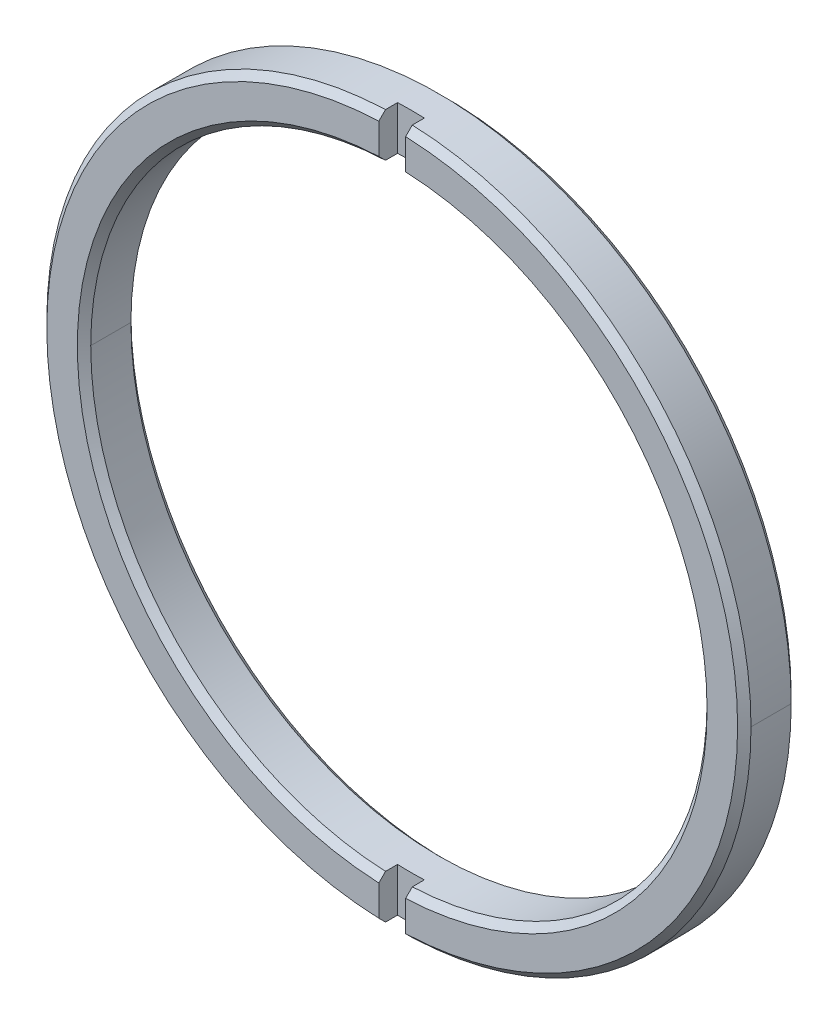
ISO-10303-21;
HEADER;
FILE_DESCRIPTION(('STEP AP214'),'2;1');
FILE_NAME('part.step','',(''),(''),'','','');
FILE_SCHEMA(('AUTOMOTIVE_DESIGN { 1 0 10303 214 1 1 1 1 }'));
ENDSEC;
DATA;
#1=APPLICATION_CONTEXT('core data for automotive mechanical design processes');
#2=APPLICATION_PROTOCOL_DEFINITION('international standard','automotive_design',2000,#1);
#3=PRODUCT_CONTEXT('',#1,'mechanical');
#4=PRODUCT('Part','Part','',(#3));
#5=PRODUCT_RELATED_PRODUCT_CATEGORY('part','',(#4));
#6=PRODUCT_DEFINITION_FORMATION('','',#4);
#7=PRODUCT_DEFINITION_CONTEXT('part definition',#1,'design');
#8=PRODUCT_DEFINITION('design','',#6,#7);
#9=PRODUCT_DEFINITION_SHAPE('','',#8);
#10=(LENGTH_UNIT() NAMED_UNIT(*) SI_UNIT(.MILLI.,.METRE.));
#11=(NAMED_UNIT(*) PLANE_ANGLE_UNIT() SI_UNIT($,.RADIAN.));
#12=(NAMED_UNIT(*) SI_UNIT($,.STERADIAN.) SOLID_ANGLE_UNIT());
#13=UNCERTAINTY_MEASURE_WITH_UNIT(LENGTH_MEASURE(1.E-05),#10,'distance_accuracy_value','');
#14=(GEOMETRIC_REPRESENTATION_CONTEXT(3) GLOBAL_UNCERTAINTY_ASSIGNED_CONTEXT((#13)) GLOBAL_UNIT_ASSIGNED_CONTEXT((#10,
#11,#12)) REPRESENTATION_CONTEXT('',''));
#15=CARTESIAN_POINT('',(0.,0.,0.));
#16=DIRECTION('',(0.,0.,1.));
#17=DIRECTION('',(1.,0.,0.));
#18=AXIS2_PLACEMENT_3D('',#15,#16,#17);
#19=CARTESIAN_POINT('',(-0.500000000000007,55.,1.3));
#20=DIRECTION('',(-1.,0.,0.));
#21=DIRECTION('',(0.,1.,0.));
#22=AXIS2_PLACEMENT_3D('',#19,#20,#21);
#23=PLANE('',#22);
#24=DIRECTION('',(0.,0.,-1.));
#25=VECTOR('',#24,1.);
#26=CARTESIAN_POINT('',(-0.5,11.4936295507555,2.));
#27=LINE('',#26,#25);
#28=CARTESIAN_POINT('',(-0.5,11.4936295507555,1.75));
#29=VERTEX_POINT('',#28);
#30=CARTESIAN_POINT('',(-0.5,11.4936295507555,1.3));
#31=VERTEX_POINT('',#30);
#32=EDGE_CURVE('E250',#29,#31,#27,.T.);
#33=ORIENTED_EDGE('',*,*,#32,.T.);
#34=DIRECTION('',(0.,-1.,0.));
#35=VECTOR('',#34,1.);
#36=CARTESIAN_POINT('',(-0.500000000000007,55.,1.3));
#37=LINE('',#36,#35);
#38=CARTESIAN_POINT('',(-0.5,13.1349868766588,1.3));
#39=VERTEX_POINT('',#38);
#40=EDGE_CURVE('E25',#39,#31,#37,.T.);
#41=ORIENTED_EDGE('',*,*,#40,.F.);
#42=DIRECTION('',(0.,0.,-1.));
#43=VECTOR('',#42,1.);
#44=CARTESIAN_POINT('',(-0.5,13.1349868766588,2.));
#45=LINE('',#44,#43);
#46=CARTESIAN_POINT('',(-0.5,13.1349868766588,1.75));
#47=VERTEX_POINT('',#46);
#48=EDGE_CURVE('E204',#47,#39,#45,.T.);
#49=ORIENTED_EDGE('',*,*,#48,.F.);
#50=CARTESIAN_POINT('',(-0.5,13.1349868766588,1.75));
#51=CARTESIAN_POINT('',(-0.5,13.0515926022637,1.83333391911205));
#52=CARTESIAN_POINT('',(-0.5,12.9681977539559,1.91666726381099));
#53=CARTESIAN_POINT('',(-0.5,12.8848022976684,2.));
#54=(BOUNDED_CURVE() B_SPLINE_CURVE(3,(#50,#51,#52,#53),.UNSPECIFIED.,.F.,
.F.) B_SPLINE_CURVE_WITH_KNOTS((4,4),(0.0223119172941757,0.0226656012251179),
.UNSPECIFIED.) CURVE() GEOMETRIC_REPRESENTATION_ITEM() RATIONAL_B_SPLINE_CURVE((1.,1.,1.,1.)) REPRESENTATION_ITEM(''));
#55=CARTESIAN_POINT('',(-0.5,12.8848022976684,2.));
#56=VERTEX_POINT('',#55);
#57=EDGE_CURVE('E216',#47,#56,#54,.T.);
#58=ORIENTED_EDGE('',*,*,#57,.T.);
#59=DIRECTION('',(0.,-1.,0.));
#60=VECTOR('',#59,1.);
#61=CARTESIAN_POINT('',(-0.500000000000007,55.,2.));
#62=LINE('',#61,#60);
#63=CARTESIAN_POINT('',(-0.5,11.7438609600931,2.));
#64=VERTEX_POINT('',#63);
#65=EDGE_CURVE('E315',#56,#64,#62,.T.);
#66=ORIENTED_EDGE('',*,*,#65,.T.);
#67=CARTESIAN_POINT('',(-0.5,11.7438609600931,2.));
#68=CARTESIAN_POINT('',(-0.5,11.6604513109038,1.91666584518184));
#69=CARTESIAN_POINT('',(-0.5,11.5770408589732,1.83333249398042));
#70=CARTESIAN_POINT('',(-0.5,11.4936295507555,1.75));
#71=(BOUNDED_CURVE() B_SPLINE_CURVE(3,(#67,#68,#69,#70),.UNSPECIFIED.,.F.,
.F.) B_SPLINE_CURVE_WITH_KNOTS((4,4),(0.0199535627771863,0.0203072798355382),
.UNSPECIFIED.) CURVE() GEOMETRIC_REPRESENTATION_ITEM() RATIONAL_B_SPLINE_CURVE((1.,1.,1.,1.)) REPRESENTATION_ITEM(''));
#72=EDGE_CURVE('E40',#64,#29,#71,.T.);
#73=ORIENTED_EDGE('',*,*,#72,.T.);
#74=EDGE_LOOP('',(#33,#41,#49,#58,#66,#73));
#75=FACE_BOUND('',#74,.T.);
#76=ADVANCED_FACE('F14',(#75),#23,.F.);
#77=CARTESIAN_POINT('',(0.499999999999993,55.,1.3));
#78=DIRECTION('',(1.,0.,0.));
#79=DIRECTION('',(0.,1.,0.));
#80=AXIS2_PLACEMENT_3D('',#77,#78,#79);
#81=PLANE('',#80);
#82=DIRECTION('',(0.,0.,1.));
#83=VECTOR('',#82,1.);
#84=CARTESIAN_POINT('',(0.5,11.4936295507555,2.));
#85=LINE('',#84,#83);
#86=CARTESIAN_POINT('',(0.5,11.4936295507555,1.3));
#87=VERTEX_POINT('',#86);
#88=CARTESIAN_POINT('',(0.5,11.4936295507555,1.75));
#89=VERTEX_POINT('',#88);
#90=EDGE_CURVE('E281',#87,#89,#85,.T.);
#91=ORIENTED_EDGE('',*,*,#90,.T.);
#92=CARTESIAN_POINT('',(0.5,11.4936295507555,1.75));
#93=CARTESIAN_POINT('',(0.5,11.5770408591299,1.83333249413706));
#94=CARTESIAN_POINT('',(0.5,11.6604513110572,1.91666584533513));
#95=CARTESIAN_POINT('',(0.5,11.7438609600931,2.));
#96=(BOUNDED_CURVE() B_SPLINE_CURVE(3,(#92,#93,#94,#95),.UNSPECIFIED.,.F.,
.F.) B_SPLINE_CURVE_WITH_KNOTS((4,4),(0.0523519426183359,0.0527083485669853),
.UNSPECIFIED.) CURVE() GEOMETRIC_REPRESENTATION_ITEM() RATIONAL_B_SPLINE_CURVE((1.,1.,1.,1.)) REPRESENTATION_ITEM(''));
#97=CARTESIAN_POINT('',(0.5,11.7438609600931,2.));
#98=VERTEX_POINT('',#97);
#99=EDGE_CURVE('E225',#89,#98,#96,.T.);
#100=ORIENTED_EDGE('',*,*,#99,.T.);
#101=DIRECTION('',(0.,1.,0.));
#102=VECTOR('',#101,1.);
#103=CARTESIAN_POINT('',(0.499999999999993,55.,2.));
#104=LINE('',#103,#102);
#105=CARTESIAN_POINT('',(0.5,12.8848022976684,2.));
#106=VERTEX_POINT('',#105);
#107=EDGE_CURVE('E328',#98,#106,#104,.T.);
#108=ORIENTED_EDGE('',*,*,#107,.T.);
#109=CARTESIAN_POINT('',(0.5,12.8848022976684,2.));
#110=CARTESIAN_POINT('',(0.5,12.9681977541026,1.91666726366442));
#111=CARTESIAN_POINT('',(0.5,13.0515926024076,1.83333391896827));
#112=CARTESIAN_POINT('',(0.5,13.1349868766588,1.75));
#113=(BOUNDED_CURVE() B_SPLINE_CURVE(3,(#109,#110,#111,#112),.UNSPECIFIED.,.F.,
.F.) B_SPLINE_CURVE_WITH_KNOTS((4,4),(0.0585562021967871,0.0589105675960562),
.UNSPECIFIED.) CURVE() GEOMETRIC_REPRESENTATION_ITEM() RATIONAL_B_SPLINE_CURVE((1.,1.,1.,1.)) REPRESENTATION_ITEM(''));
#114=CARTESIAN_POINT('',(0.5,13.1349868766588,1.75));
#115=VERTEX_POINT('',#114);
#116=EDGE_CURVE('E164',#106,#115,#113,.T.);
#117=ORIENTED_EDGE('',*,*,#116,.T.);
#118=DIRECTION('',(0.,0.,1.));
#119=VECTOR('',#118,1.);
#120=CARTESIAN_POINT('',(0.5,13.1349868766588,2.));
#121=LINE('',#120,#119);
#122=CARTESIAN_POINT('',(0.5,13.1349868766588,1.3));
#123=VERTEX_POINT('',#122);
#124=EDGE_CURVE('E194',#123,#115,#121,.T.);
#125=ORIENTED_EDGE('',*,*,#124,.F.);
#126=DIRECTION('',(0.,1.,0.));
#127=VECTOR('',#126,1.);
#128=CARTESIAN_POINT('',(0.499999999999993,55.,1.3));
#129=LINE('',#128,#127);
#130=EDGE_CURVE('E9',#87,#123,#129,.T.);
#131=ORIENTED_EDGE('',*,*,#130,.F.);
#132=EDGE_LOOP('',(#91,#100,#108,#117,#125,#131));
#133=FACE_BOUND('',#132,.T.);
#134=ADVANCED_FACE('F681',(#133),#81,.F.);
#135=CARTESIAN_POINT('',(0.,0.,1.3));
#136=DIRECTION('',(0.,0.,1.));
#137=DIRECTION('',(1.,0.,0.));
#138=AXIS2_PLACEMENT_3D('',#135,#136,#137);
#139=PLANE('',#138);
#140=CARTESIAN_POINT('',(0.,0.,1.3));
#141=DIRECTION('',(0.,0.,1.));
#142=DIRECTION('',(1.,0.,0.));
#143=AXIS2_PLACEMENT_3D('',#140,#141,#142);
#144=CIRCLE('',#143,13.1445);
#145=EDGE_CURVE('E208',#123,#39,#144,.T.);
#146=ORIENTED_EDGE('',*,*,#145,.T.);
#147=ORIENTED_EDGE('',*,*,#40,.T.);
#148=CARTESIAN_POINT('',(0.,0.,1.3));
#149=DIRECTION('',(0.,0.,1.));
#150=DIRECTION('',(1.,0.,0.));
#151=AXIS2_PLACEMENT_3D('',#148,#149,#150);
#152=CIRCLE('',#151,11.5045);
#153=EDGE_CURVE('E252',#87,#31,#152,.T.);
#154=ORIENTED_EDGE('',*,*,#153,.F.);
#155=ORIENTED_EDGE('',*,*,#130,.T.);
#156=EDGE_LOOP('',(#146,#147,#154,#155));
#157=FACE_BOUND('',#156,.T.);
#158=ADVANCED_FACE('F457',(#157),#139,.T.);
#159=CARTESIAN_POINT('',(0.,0.,1.3));
#160=DIRECTION('',(0.,0.,1.));
#161=DIRECTION('',(1.,0.,0.));
#162=AXIS2_PLACEMENT_3D('',#159,#160,#161);
#163=PLANE('',#162);
#164=CARTESIAN_POINT('',(0.,0.,1.3));
#165=DIRECTION('',(0.,0.,1.));
#166=DIRECTION('',(1.,0.,0.));
#167=AXIS2_PLACEMENT_3D('',#164,#165,#166);
#168=CIRCLE('',#167,13.1445);
#169=CARTESIAN_POINT('',(-0.5,-13.1349868766588,1.3));
#170=VERTEX_POINT('',#169);
#171=CARTESIAN_POINT('',(0.5,-13.1349868766588,1.3));
#172=VERTEX_POINT('',#171);
#173=EDGE_CURVE('E151',#170,#172,#168,.T.);
#174=ORIENTED_EDGE('',*,*,#173,.T.);
#175=DIRECTION('',(0.,1.,0.));
#176=VECTOR('',#175,1.);
#177=CARTESIAN_POINT('',(0.499999999999993,55.,1.3));
#178=LINE('',#177,#176);
#179=CARTESIAN_POINT('',(0.5,-11.4936295507555,1.3));
#180=VERTEX_POINT('',#179);
#181=EDGE_CURVE('E146',#172,#180,#178,.T.);
#182=ORIENTED_EDGE('',*,*,#181,.T.);
#183=CARTESIAN_POINT('',(0.,0.,1.3));
#184=DIRECTION('',(0.,0.,1.));
#185=DIRECTION('',(1.,0.,0.));
#186=AXIS2_PLACEMENT_3D('',#183,#184,#185);
#187=CIRCLE('',#186,11.5045);
#188=CARTESIAN_POINT('',(-0.5,-11.4936295507555,1.3));
#189=VERTEX_POINT('',#188);
#190=EDGE_CURVE('E202',#189,#180,#187,.T.);
#191=ORIENTED_EDGE('',*,*,#190,.F.);
#192=DIRECTION('',(0.,-1.,0.));
#193=VECTOR('',#192,1.);
#194=CARTESIAN_POINT('',(-0.500000000000007,55.,1.3));
#195=LINE('',#194,#193);
#196=EDGE_CURVE('E195',#189,#170,#195,.T.);
#197=ORIENTED_EDGE('',*,*,#196,.T.);
#198=EDGE_LOOP('',(#174,#182,#191,#197));
#199=FACE_BOUND('',#198,.T.);
#200=ADVANCED_FACE('F509',(#199),#163,.T.);
#201=CARTESIAN_POINT('',(-0.500000000000007,55.,1.3));
#202=DIRECTION('',(-1.,0.,0.));
#203=DIRECTION('',(0.,1.,0.));
#204=AXIS2_PLACEMENT_3D('',#201,#202,#203);
#205=PLANE('',#204);
#206=DIRECTION('',(0.,0.,1.));
#207=VECTOR('',#206,1.);
#208=CARTESIAN_POINT('',(-0.5,-11.4936295507555,2.));
#209=LINE('',#208,#207);
#210=CARTESIAN_POINT('',(-0.5,-11.4936295507555,1.75));
#211=VERTEX_POINT('',#210);
#212=EDGE_CURVE('E199',#189,#211,#209,.T.);
#213=ORIENTED_EDGE('',*,*,#212,.T.);
#214=CARTESIAN_POINT('',(-0.5,-11.4936295507555,1.75));
#215=CARTESIAN_POINT('',(-0.5,-11.5770408591299,1.83333249413706));
#216=CARTESIAN_POINT('',(-0.5,-11.6604513110572,1.91666584533514));
#217=CARTESIAN_POINT('',(-0.5,-11.7438609600931,2.));
#218=(BOUNDED_CURVE() B_SPLINE_CURVE(3,(#214,#215,#216,#217),.UNSPECIFIED.,.F.,
.F.) B_SPLINE_CURVE_WITH_KNOTS((4,4),(0.0523519426183359,0.0527083485669853),
.UNSPECIFIED.) CURVE() GEOMETRIC_REPRESENTATION_ITEM() RATIONAL_B_SPLINE_CURVE((1.,1.,1.,1.)) REPRESENTATION_ITEM(''));
#219=CARTESIAN_POINT('',(-0.5,-11.7438609600931,2.));
#220=VERTEX_POINT('',#219);
#221=EDGE_CURVE('E65',#211,#220,#218,.T.);
#222=ORIENTED_EDGE('',*,*,#221,.T.);
#223=DIRECTION('',(0.,-1.,0.));
#224=VECTOR('',#223,1.);
#225=CARTESIAN_POINT('',(-0.500000000000007,55.,2.));
#226=LINE('',#225,#224);
#227=CARTESIAN_POINT('',(-0.5,-12.8848022976684,2.));
#228=VERTEX_POINT('',#227);
#229=EDGE_CURVE('E258',#220,#228,#226,.T.);
#230=ORIENTED_EDGE('',*,*,#229,.T.);
#231=CARTESIAN_POINT('',(-0.5,-12.8848022976684,2.));
#232=CARTESIAN_POINT('',(-0.5,-12.9681977541026,1.91666726366442));
#233=CARTESIAN_POINT('',(-0.5,-13.0515926024076,1.83333391896827));
#234=CARTESIAN_POINT('',(-0.5,-13.1349868766588,1.75));
#235=(BOUNDED_CURVE() B_SPLINE_CURVE(3,(#231,#232,#233,#234),.UNSPECIFIED.,.F.,
.F.) B_SPLINE_CURVE_WITH_KNOTS((4,4),(0.0585562021967871,0.0589105675960563),
.UNSPECIFIED.) CURVE() GEOMETRIC_REPRESENTATION_ITEM() RATIONAL_B_SPLINE_CURVE((1.,1.,1.,1.)) REPRESENTATION_ITEM(''));
#236=CARTESIAN_POINT('',(-0.5,-13.1349868766588,1.75));
#237=VERTEX_POINT('',#236);
#238=EDGE_CURVE('E217',#228,#237,#235,.T.);
#239=ORIENTED_EDGE('',*,*,#238,.T.);
#240=DIRECTION('',(0.,0.,1.));
#241=VECTOR('',#240,1.);
#242=CARTESIAN_POINT('',(-0.5,-13.1349868766588,2.));
#243=LINE('',#242,#241);
#244=EDGE_CURVE('E340',#170,#237,#243,.T.);
#245=ORIENTED_EDGE('',*,*,#244,.F.);
#246=ORIENTED_EDGE('',*,*,#196,.F.);
#247=EDGE_LOOP('',(#213,#222,#230,#239,#245,#246));
#248=FACE_BOUND('',#247,.T.);
#249=ADVANCED_FACE('F516',(#248),#205,.F.);
#250=CARTESIAN_POINT('',(0.499999999999993,55.,1.3));
#251=DIRECTION('',(1.,0.,0.));
#252=DIRECTION('',(0.,1.,0.));
#253=AXIS2_PLACEMENT_3D('',#250,#251,#252);
#254=PLANE('',#253);
#255=DIRECTION('',(0.,0.,-1.));
#256=VECTOR('',#255,1.);
#257=CARTESIAN_POINT('',(0.5,-11.4936295507555,2.));
#258=LINE('',#257,#256);
#259=CARTESIAN_POINT('',(0.5,-11.4936295507555,1.75));
#260=VERTEX_POINT('',#259);
#261=EDGE_CURVE('E213',#260,#180,#258,.T.);
#262=ORIENTED_EDGE('',*,*,#261,.T.);
#263=ORIENTED_EDGE('',*,*,#181,.F.);
#264=DIRECTION('',(0.,0.,-1.));
#265=VECTOR('',#264,1.);
#266=CARTESIAN_POINT('',(0.5,-13.1349868766588,2.));
#267=LINE('',#266,#265);
#268=CARTESIAN_POINT('',(0.5,-13.1349868766588,1.75));
#269=VERTEX_POINT('',#268);
#270=EDGE_CURVE('E136',#269,#172,#267,.T.);
#271=ORIENTED_EDGE('',*,*,#270,.F.);
#272=CARTESIAN_POINT('',(0.5,-13.1349868766588,1.75));
#273=CARTESIAN_POINT('',(0.5,-13.0515926022637,1.83333391911205));
#274=CARTESIAN_POINT('',(0.5,-12.9681977539559,1.91666726381099));
#275=CARTESIAN_POINT('',(0.5,-12.8848022976684,2.));
#276=(BOUNDED_CURVE() B_SPLINE_CURVE(3,(#272,#273,#274,#275),.UNSPECIFIED.,.F.,
.F.) B_SPLINE_CURVE_WITH_KNOTS((4,4),(0.0223119172941757,0.0226656012251179),
.UNSPECIFIED.) CURVE() GEOMETRIC_REPRESENTATION_ITEM() RATIONAL_B_SPLINE_CURVE((1.,1.,1.,1.)) REPRESENTATION_ITEM(''));
#277=CARTESIAN_POINT('',(0.5,-12.8848022976684,2.));
#278=VERTEX_POINT('',#277);
#279=EDGE_CURVE('E142',#269,#278,#276,.T.);
#280=ORIENTED_EDGE('',*,*,#279,.T.);
#281=DIRECTION('',(0.,1.,0.));
#282=VECTOR('',#281,1.);
#283=CARTESIAN_POINT('',(0.499999999999993,55.,2.));
#284=LINE('',#283,#282);
#285=CARTESIAN_POINT('',(0.5,-11.7438609600931,2.));
#286=VERTEX_POINT('',#285);
#287=EDGE_CURVE('E234',#278,#286,#284,.T.);
#288=ORIENTED_EDGE('',*,*,#287,.T.);
#289=CARTESIAN_POINT('',(0.5,-11.7438609600931,2.));
#290=CARTESIAN_POINT('',(0.5,-11.6604513109038,1.91666584518184));
#291=CARTESIAN_POINT('',(0.5,-11.5770408589732,1.83333249398043));
#292=CARTESIAN_POINT('',(0.5,-11.4936295507555,1.75));
#293=(BOUNDED_CURVE() B_SPLINE_CURVE(3,(#289,#290,#291,#292),.UNSPECIFIED.,.F.,
.F.) B_SPLINE_CURVE_WITH_KNOTS((4,4),(0.0199535627771863,0.0203072798355382),
.UNSPECIFIED.) CURVE() GEOMETRIC_REPRESENTATION_ITEM() RATIONAL_B_SPLINE_CURVE((1.,1.,1.,1.)) REPRESENTATION_ITEM(''));
#294=EDGE_CURVE('E171',#286,#260,#293,.T.);
#295=ORIENTED_EDGE('',*,*,#294,.T.);
#296=EDGE_LOOP('',(#262,#263,#271,#280,#288,#295));
#297=FACE_BOUND('',#296,.T.);
#298=ADVANCED_FACE('F139',(#297),#254,.F.);
#299=CARTESIAN_POINT('',(0.,0.,2.));
#300=DIRECTION('',(0.,0.,-1.));
#301=DIRECTION('',(-1.,0.,0.));
#302=AXIS2_PLACEMENT_3D('',#299,#300,#301);
#303=CONICAL_SURFACE('',#302,12.8945,0.785398163397438);
#304=DIRECTION('',(-0.70710678118654,0.,-0.707106781186555));
#305=VECTOR('',#304,1.);
#306=CARTESIAN_POINT('',(-12.8945,0.,2.));
#307=LINE('',#306,#305);
#308=CARTESIAN_POINT('',(-12.8945,0.,2.));
#309=VERTEX_POINT('',#308);
#310=CARTESIAN_POINT('',(-13.1445,0.,1.75));
#311=VERTEX_POINT('',#310);
#312=EDGE_CURVE('E254',#309,#311,#307,.T.);
#313=ORIENTED_EDGE('',*,*,#312,.F.);
#314=CARTESIAN_POINT('',(0.,0.,2.));
#315=DIRECTION('',(0.,0.,1.));
#316=DIRECTION('',(1.,0.,0.));
#317=AXIS2_PLACEMENT_3D('',#314,#315,#316);
#318=CIRCLE('',#317,12.8945);
#319=EDGE_CURVE('E263',#56,#309,#318,.T.);
#320=ORIENTED_EDGE('',*,*,#319,.F.);
#321=ORIENTED_EDGE('',*,*,#57,.F.);
#322=CARTESIAN_POINT('',(0.,0.,1.75));
#323=DIRECTION('',(0.,0.,-1.));
#324=DIRECTION('',(1.,0.,0.));
#325=AXIS2_PLACEMENT_3D('',#322,#323,#324);
#326=CIRCLE('',#325,13.1445);
#327=EDGE_CURVE('E209',#311,#47,#326,.T.);
#328=ORIENTED_EDGE('',*,*,#327,.F.);
#329=EDGE_LOOP('',(#313,#320,#321,#328));
#330=FACE_BOUND('',#329,.T.);
#331=ADVANCED_FACE('F398',(#330),#303,.T.);
#332=CARTESIAN_POINT('',(0.,0.,0.250000000000004));
#333=DIRECTION('',(0.,0.,1.));
#334=DIRECTION('',(1.,0.,0.));
#335=AXIS2_PLACEMENT_3D('',#332,#333,#334);
#336=CONICAL_SURFACE('',#335,13.1445,0.785398163397452);
#337=DIRECTION('',(-0.70710678118655,0.,0.707106781186545));
#338=VECTOR('',#337,1.);
#339=CARTESIAN_POINT('',(-13.1445,0.,0.250000000000004));
#340=LINE('',#339,#338);
#341=CARTESIAN_POINT('',(-12.8945,0.,0.));
#342=VERTEX_POINT('',#341);
#343=CARTESIAN_POINT('',(-13.1445,0.,0.250000000000004));
#344=VERTEX_POINT('',#343);
#345=EDGE_CURVE('E268',#342,#344,#340,.T.);
#346=ORIENTED_EDGE('',*,*,#345,.F.);
#347=CARTESIAN_POINT('',(0.,0.,0.));
#348=DIRECTION('',(0.,0.,-1.));
#349=DIRECTION('',(1.,0.,0.));
#350=AXIS2_PLACEMENT_3D('',#347,#348,#349);
#351=CIRCLE('',#350,12.8945);
#352=CARTESIAN_POINT('',(12.8945,0.,0.));
#353=VERTEX_POINT('',#352);
#354=EDGE_CURVE('E241',#353,#342,#351,.T.);
#355=ORIENTED_EDGE('',*,*,#354,.F.);
#356=DIRECTION('',(0.70710678118655,0.,0.707106781186545));
#357=VECTOR('',#356,1.);
#358=CARTESIAN_POINT('',(13.1445,0.,0.250000000000004));
#359=LINE('',#358,#357);
#360=CARTESIAN_POINT('',(13.1445,0.,0.250000000000004));
#361=VERTEX_POINT('',#360);
#362=EDGE_CURVE('E309',#353,#361,#359,.T.);
#363=ORIENTED_EDGE('',*,*,#362,.T.);
#364=CARTESIAN_POINT('',(0.,0.,0.250000000000004));
#365=DIRECTION('',(0.,0.,1.));
#366=DIRECTION('',(1.,0.,0.));
#367=AXIS2_PLACEMENT_3D('',#364,#365,#366);
#368=CIRCLE('',#367,13.1445);
#369=EDGE_CURVE('E285',#344,#361,#368,.T.);
#370=ORIENTED_EDGE('',*,*,#369,.F.);
#371=EDGE_LOOP('',(#346,#355,#363,#370));
#372=FACE_BOUND('',#371,.T.);
#373=ADVANCED_FACE('F723',(#372),#336,.T.);
#374=CARTESIAN_POINT('',(0.,0.,0.));
#375=DIRECTION('',(0.,0.,-1.));
#376=DIRECTION('',(-1.,0.,0.));
#377=AXIS2_PLACEMENT_3D('',#374,#375,#376);
#378=CONICAL_SURFACE('',#377,11.7545,0.785398163397438);
#379=DIRECTION('',(0.70710678118654,0.,-0.707106781186555));
#380=VECTOR('',#379,1.);
#381=CARTESIAN_POINT('',(11.7545,0.,0.));
#382=LINE('',#381,#380);
#383=CARTESIAN_POINT('',(11.5045,0.,0.25));
#384=VERTEX_POINT('',#383);
#385=CARTESIAN_POINT('',(11.7545,0.,0.));
#386=VERTEX_POINT('',#385);
#387=EDGE_CURVE('E308',#384,#386,#382,.T.);
#388=ORIENTED_EDGE('',*,*,#387,.F.);
#389=CARTESIAN_POINT('',(0.,0.,0.25));
#390=DIRECTION('',(0.,0.,-1.));
#391=DIRECTION('',(1.,0.,0.));
#392=AXIS2_PLACEMENT_3D('',#389,#390,#391);
#393=CIRCLE('',#392,11.5045);
#394=CARTESIAN_POINT('',(-11.5045,0.,0.25));
#395=VERTEX_POINT('',#394);
#396=EDGE_CURVE('E270',#395,#384,#393,.T.);
#397=ORIENTED_EDGE('',*,*,#396,.F.);
#398=DIRECTION('',(-0.70710678118654,0.,-0.707106781186555));
#399=VECTOR('',#398,1.);
#400=CARTESIAN_POINT('',(-11.7545,0.,0.));
#401=LINE('',#400,#399);
#402=CARTESIAN_POINT('',(-11.7545,0.,0.));
#403=VERTEX_POINT('',#402);
#404=EDGE_CURVE('E247',#395,#403,#401,.T.);
#405=ORIENTED_EDGE('',*,*,#404,.T.);
#406=CARTESIAN_POINT('',(0.,0.,0.));
#407=DIRECTION('',(0.,0.,1.));
#408=DIRECTION('',(1.,0.,0.));
#409=AXIS2_PLACEMENT_3D('',#406,#407,#408);
#410=CIRCLE('',#409,11.7545);
#411=EDGE_CURVE('E152',#386,#403,#410,.T.);
#412=ORIENTED_EDGE('',*,*,#411,.F.);
#413=EDGE_LOOP('',(#388,#397,#405,#412));
#414=FACE_BOUND('',#413,.T.);
#415=ADVANCED_FACE('F719',(#414),#378,.F.);
#416=CARTESIAN_POINT('',(0.,0.,1.75));
#417=DIRECTION('',(0.,0.,1.));
#418=DIRECTION('',(1.,0.,0.));
#419=AXIS2_PLACEMENT_3D('',#416,#417,#418);
#420=CONICAL_SURFACE('',#419,11.5045,0.785398163397452);
#421=ORIENTED_EDGE('',*,*,#72,.F.);
#422=CARTESIAN_POINT('',(0.,0.,2.));
#423=DIRECTION('',(0.,0.,-1.));
#424=DIRECTION('',(1.,0.,0.));
#425=AXIS2_PLACEMENT_3D('',#422,#423,#424);
#426=CIRCLE('',#425,11.7545);
#427=EDGE_CURVE('E262',#220,#64,#426,.T.);
#428=ORIENTED_EDGE('',*,*,#427,.F.);
#429=ORIENTED_EDGE('',*,*,#221,.F.);
#430=CARTESIAN_POINT('',(0.,0.,1.75));
#431=DIRECTION('',(0.,0.,1.));
#432=DIRECTION('',(1.,0.,0.));
#433=AXIS2_PLACEMENT_3D('',#430,#431,#432);
#434=CIRCLE('',#433,11.5045);
#435=CARTESIAN_POINT('',(-11.5045,0.,1.75));
#436=VERTEX_POINT('',#435);
#437=EDGE_CURVE('E203',#436,#211,#434,.T.);
#438=ORIENTED_EDGE('',*,*,#437,.F.);
#439=CARTESIAN_POINT('',(0.,0.,1.75));
#440=DIRECTION('',(0.,0.,1.));
#441=DIRECTION('',(1.,0.,0.));
#442=AXIS2_PLACEMENT_3D('',#439,#440,#441);
#443=CIRCLE('',#442,11.5045);
#444=EDGE_CURVE('E82',#29,#436,#443,.T.);
#445=ORIENTED_EDGE('',*,*,#444,.F.);
#446=EDGE_LOOP('',(#421,#428,#429,#438,#445));
#447=FACE_BOUND('',#446,.T.);
#448=ADVANCED_FACE('F488',(#447),#420,.F.);
#449=CARTESIAN_POINT('',(0.,0.,2.));
#450=DIRECTION('',(0.,0.,-1.));
#451=DIRECTION('',(-1.,0.,0.));
#452=AXIS2_PLACEMENT_3D('',#449,#450,#451);
#453=CYLINDRICAL_SURFACE('',#452,11.5045);
#454=DIRECTION('',(0.,0.,-1.));
#455=VECTOR('',#454,1.);
#456=CARTESIAN_POINT('',(11.5045,0.,2.));
#457=LINE('',#456,#455);
#458=CARTESIAN_POINT('',(11.5045,0.,1.75));
#459=VERTEX_POINT('',#458);
#460=EDGE_CURVE('E246',#459,#384,#457,.T.);
#461=ORIENTED_EDGE('',*,*,#460,.F.);
#462=CARTESIAN_POINT('',(0.,0.,1.75));
#463=DIRECTION('',(0.,0.,1.));
#464=DIRECTION('',(1.,0.,0.));
#465=AXIS2_PLACEMENT_3D('',#462,#463,#464);
#466=CIRCLE('',#465,11.5045);
#467=EDGE_CURVE('E187',#459,#89,#466,.T.);
#468=ORIENTED_EDGE('',*,*,#467,.T.);
#469=ORIENTED_EDGE('',*,*,#90,.F.);
#470=ORIENTED_EDGE('',*,*,#153,.T.);
#471=ORIENTED_EDGE('',*,*,#32,.F.);
#472=ORIENTED_EDGE('',*,*,#444,.T.);
#473=DIRECTION('',(0.,0.,-1.));
#474=VECTOR('',#473,1.);
#475=CARTESIAN_POINT('',(-11.5045,0.,2.));
#476=LINE('',#475,#474);
#477=EDGE_CURVE('E347',#436,#395,#476,.T.);
#478=ORIENTED_EDGE('',*,*,#477,.T.);
#479=ORIENTED_EDGE('',*,*,#396,.T.);
#480=EDGE_LOOP('',(#461,#468,#469,#470,#471,#472,#478,#479));
#481=FACE_BOUND('',#480,.T.);
#482=ADVANCED_FACE('F492',(#481),#453,.F.);
#483=CARTESIAN_POINT('',(0.,0.,2.));
#484=DIRECTION('',(0.,0.,-1.));
#485=DIRECTION('',(-1.,0.,0.));
#486=AXIS2_PLACEMENT_3D('',#483,#484,#485);
#487=CYLINDRICAL_SURFACE('',#486,13.1445);
#488=DIRECTION('',(0.,0.,-1.));
#489=VECTOR('',#488,1.);
#490=CARTESIAN_POINT('',(13.1445,0.,2.));
#491=LINE('',#490,#489);
#492=CARTESIAN_POINT('',(13.1445,0.,1.75));
#493=VERTEX_POINT('',#492);
#494=EDGE_CURVE('E159',#493,#361,#491,.T.);
#495=ORIENTED_EDGE('',*,*,#494,.F.);
#496=CARTESIAN_POINT('',(0.,0.,1.75));
#497=DIRECTION('',(0.,0.,-1.));
#498=DIRECTION('',(1.,0.,0.));
#499=AXIS2_PLACEMENT_3D('',#496,#497,#498);
#500=CIRCLE('',#499,13.1445);
#501=EDGE_CURVE('E155',#493,#269,#500,.T.);
#502=ORIENTED_EDGE('',*,*,#501,.T.);
#503=ORIENTED_EDGE('',*,*,#270,.T.);
#504=ORIENTED_EDGE('',*,*,#173,.F.);
#505=ORIENTED_EDGE('',*,*,#244,.T.);
#506=CARTESIAN_POINT('',(0.,0.,1.75));
#507=DIRECTION('',(0.,0.,-1.));
#508=DIRECTION('',(1.,0.,0.));
#509=AXIS2_PLACEMENT_3D('',#506,#507,#508);
#510=CIRCLE('',#509,13.1445);
#511=EDGE_CURVE('E224',#237,#311,#510,.T.);
#512=ORIENTED_EDGE('',*,*,#511,.T.);
#513=DIRECTION('',(0.,0.,-1.));
#514=VECTOR('',#513,1.);
#515=CARTESIAN_POINT('',(-13.1445,0.,2.));
#516=LINE('',#515,#514);
#517=EDGE_CURVE('E294',#311,#344,#516,.T.);
#518=ORIENTED_EDGE('',*,*,#517,.T.);
#519=ORIENTED_EDGE('',*,*,#369,.T.);
#520=EDGE_LOOP('',(#495,#502,#503,#504,#505,#512,#518,#519));
#521=FACE_BOUND('',#520,.T.);
#522=ADVANCED_FACE('F156',(#521),#487,.T.);
#523=CARTESIAN_POINT('',(0.,0.,0.));
#524=DIRECTION('',(0.,0.,1.));
#525=DIRECTION('',(1.,0.,0.));
#526=AXIS2_PLACEMENT_3D('',#523,#524,#525);
#527=PLANE('',#526);
#528=CARTESIAN_POINT('',(0.,0.,0.));
#529=DIRECTION('',(0.,0.,1.));
#530=DIRECTION('',(1.,0.,0.));
#531=AXIS2_PLACEMENT_3D('',#528,#529,#530);
#532=CIRCLE('',#531,11.7545);
#533=EDGE_CURVE('E316',#403,#386,#532,.T.);
#534=ORIENTED_EDGE('',*,*,#533,.T.);
#535=ORIENTED_EDGE('',*,*,#411,.T.);
#536=EDGE_LOOP('',(#534,#535));
#537=FACE_BOUND('',#536,.T.);
#538=ORIENTED_EDGE('',*,*,#354,.T.);
#539=CARTESIAN_POINT('',(0.,0.,0.));
#540=DIRECTION('',(0.,0.,-1.));
#541=DIRECTION('',(1.,0.,0.));
#542=AXIS2_PLACEMENT_3D('',#539,#540,#541);
#543=CIRCLE('',#542,12.8945);
#544=EDGE_CURVE('E223',#342,#353,#543,.T.);
#545=ORIENTED_EDGE('',*,*,#544,.T.);
#546=EDGE_LOOP('',(#538,#545));
#547=FACE_BOUND('',#546,.T.);
#548=ADVANCED_FACE('F676',(#537,#547),#527,.F.);
#549=CARTESIAN_POINT('',(0.,0.,2.));
#550=DIRECTION('',(0.,0.,1.));
#551=DIRECTION('',(1.,0.,0.));
#552=AXIS2_PLACEMENT_3D('',#549,#550,#551);
#553=PLANE('',#552);
#554=ORIENTED_EDGE('',*,*,#65,.F.);
#555=ORIENTED_EDGE('',*,*,#319,.T.);
#556=CARTESIAN_POINT('',(0.,0.,2.));
#557=DIRECTION('',(0.,0.,1.));
#558=DIRECTION('',(1.,0.,0.));
#559=AXIS2_PLACEMENT_3D('',#556,#557,#558);
#560=CIRCLE('',#559,12.8945);
#561=EDGE_CURVE('E185',#309,#228,#560,.T.);
#562=ORIENTED_EDGE('',*,*,#561,.T.);
#563=ORIENTED_EDGE('',*,*,#229,.F.);
#564=ORIENTED_EDGE('',*,*,#427,.T.);
#565=EDGE_LOOP('',(#554,#555,#562,#563,#564));
#566=FACE_BOUND('',#565,.T.);
#567=ADVANCED_FACE('F486',(#566),#553,.T.);
#568=CARTESIAN_POINT('',(0.,0.,2.));
#569=DIRECTION('',(0.,0.,-1.));
#570=DIRECTION('',(-1.,0.,0.));
#571=AXIS2_PLACEMENT_3D('',#568,#569,#570);
#572=CONICAL_SURFACE('',#571,12.8945,0.785398163397438);
#573=ORIENTED_EDGE('',*,*,#279,.F.);
#574=ORIENTED_EDGE('',*,*,#501,.F.);
#575=CARTESIAN_POINT('',(0.,0.,1.75));
#576=DIRECTION('',(0.,0.,-1.));
#577=DIRECTION('',(1.,0.,0.));
#578=AXIS2_PLACEMENT_3D('',#575,#576,#577);
#579=CIRCLE('',#578,13.1445);
#580=EDGE_CURVE('E280',#115,#493,#579,.T.);
#581=ORIENTED_EDGE('',*,*,#580,.F.);
#582=ORIENTED_EDGE('',*,*,#116,.F.);
#583=CARTESIAN_POINT('',(0.,0.,2.));
#584=DIRECTION('',(0.,0.,1.));
#585=DIRECTION('',(1.,0.,0.));
#586=AXIS2_PLACEMENT_3D('',#583,#584,#585);
#587=CIRCLE('',#586,12.8945);
#588=EDGE_CURVE('E168',#278,#106,#587,.T.);
#589=ORIENTED_EDGE('',*,*,#588,.F.);
#590=EDGE_LOOP('',(#573,#574,#581,#582,#589));
#591=FACE_BOUND('',#590,.T.);
#592=ADVANCED_FACE('F166',(#591),#572,.T.);
#593=CARTESIAN_POINT('',(0.,0.,1.75));
#594=DIRECTION('',(0.,0.,1.));
#595=DIRECTION('',(1.,0.,0.));
#596=AXIS2_PLACEMENT_3D('',#593,#594,#595);
#597=CONICAL_SURFACE('',#596,11.5045,0.785398163397452);
#598=DIRECTION('',(0.70710678118655,0.,0.707106781186545));
#599=VECTOR('',#598,1.);
#600=CARTESIAN_POINT('',(11.5045,0.,1.75));
#601=LINE('',#600,#599);
#602=CARTESIAN_POINT('',(11.7545,0.,2.));
#603=VERTEX_POINT('',#602);
#604=EDGE_CURVE('E193',#459,#603,#601,.T.);
#605=ORIENTED_EDGE('',*,*,#604,.F.);
#606=CARTESIAN_POINT('',(0.,0.,1.75));
#607=DIRECTION('',(0.,0.,1.));
#608=DIRECTION('',(1.,0.,0.));
#609=AXIS2_PLACEMENT_3D('',#606,#607,#608);
#610=CIRCLE('',#609,11.5045);
#611=EDGE_CURVE('E242',#260,#459,#610,.T.);
#612=ORIENTED_EDGE('',*,*,#611,.F.);
#613=ORIENTED_EDGE('',*,*,#294,.F.);
#614=CARTESIAN_POINT('',(0.,0.,2.));
#615=DIRECTION('',(0.,0.,-1.));
#616=DIRECTION('',(1.,0.,0.));
#617=AXIS2_PLACEMENT_3D('',#614,#615,#616);
#618=CIRCLE('',#617,11.7545);
#619=EDGE_CURVE('E179',#603,#286,#618,.T.);
#620=ORIENTED_EDGE('',*,*,#619,.F.);
#621=EDGE_LOOP('',(#605,#612,#613,#620));
#622=FACE_BOUND('',#621,.T.);
#623=ADVANCED_FACE('F16',(#622),#597,.F.);
#624=CARTESIAN_POINT('',(0.,0.,2.));
#625=DIRECTION('',(0.,0.,1.));
#626=DIRECTION('',(1.,0.,0.));
#627=AXIS2_PLACEMENT_3D('',#624,#625,#626);
#628=PLANE('',#627);
#629=ORIENTED_EDGE('',*,*,#287,.F.);
#630=ORIENTED_EDGE('',*,*,#588,.T.);
#631=ORIENTED_EDGE('',*,*,#107,.F.);
#632=CARTESIAN_POINT('',(0.,0.,2.));
#633=DIRECTION('',(0.,0.,-1.));
#634=DIRECTION('',(1.,0.,0.));
#635=AXIS2_PLACEMENT_3D('',#632,#633,#634);
#636=CIRCLE('',#635,11.7545);
#637=EDGE_CURVE('E18',#98,#603,#636,.T.);
#638=ORIENTED_EDGE('',*,*,#637,.T.);
#639=ORIENTED_EDGE('',*,*,#619,.T.);
#640=EDGE_LOOP('',(#629,#630,#631,#638,#639));
#641=FACE_BOUND('',#640,.T.);
#642=ADVANCED_FACE('F751',(#641),#628,.T.);
#643=CARTESIAN_POINT('',(0.,0.,1.75));
#644=DIRECTION('',(0.,0.,1.));
#645=DIRECTION('',(1.,0.,0.));
#646=AXIS2_PLACEMENT_3D('',#643,#644,#645);
#647=CONICAL_SURFACE('',#646,11.5045,0.785398163397452);
#648=ORIENTED_EDGE('',*,*,#467,.F.);
#649=ORIENTED_EDGE('',*,*,#604,.T.);
#650=ORIENTED_EDGE('',*,*,#637,.F.);
#651=ORIENTED_EDGE('',*,*,#99,.F.);
#652=EDGE_LOOP('',(#648,#649,#650,#651));
#653=FACE_BOUND('',#652,.T.);
#654=ADVANCED_FACE('F755',(#653),#647,.F.);
#655=CARTESIAN_POINT('',(0.,0.,2.));
#656=DIRECTION('',(0.,0.,-1.));
#657=DIRECTION('',(-1.,0.,0.));
#658=AXIS2_PLACEMENT_3D('',#655,#656,#657);
#659=CYLINDRICAL_SURFACE('',#658,13.1445);
#660=ORIENTED_EDGE('',*,*,#580,.T.);
#661=ORIENTED_EDGE('',*,*,#494,.T.);
#662=CARTESIAN_POINT('',(0.,0.,0.250000000000004));
#663=DIRECTION('',(0.,0.,1.));
#664=DIRECTION('',(1.,0.,0.));
#665=AXIS2_PLACEMENT_3D('',#662,#663,#664);
#666=CIRCLE('',#665,13.1445);
#667=EDGE_CURVE('E277',#361,#344,#666,.T.);
#668=ORIENTED_EDGE('',*,*,#667,.T.);
#669=ORIENTED_EDGE('',*,*,#517,.F.);
#670=ORIENTED_EDGE('',*,*,#327,.T.);
#671=ORIENTED_EDGE('',*,*,#48,.T.);
#672=ORIENTED_EDGE('',*,*,#145,.F.);
#673=ORIENTED_EDGE('',*,*,#124,.T.);
#674=EDGE_LOOP('',(#660,#661,#668,#669,#670,#671,#672,#673));
#675=FACE_BOUND('',#674,.T.);
#676=ADVANCED_FACE('F463',(#675),#659,.T.);
#677=CARTESIAN_POINT('',(0.,0.,2.));
#678=DIRECTION('',(0.,0.,-1.));
#679=DIRECTION('',(-1.,0.,0.));
#680=AXIS2_PLACEMENT_3D('',#677,#678,#679);
#681=CYLINDRICAL_SURFACE('',#680,11.5045);
#682=ORIENTED_EDGE('',*,*,#611,.T.);
#683=ORIENTED_EDGE('',*,*,#460,.T.);
#684=CARTESIAN_POINT('',(0.,0.,0.25));
#685=DIRECTION('',(0.,0.,-1.));
#686=DIRECTION('',(1.,0.,0.));
#687=AXIS2_PLACEMENT_3D('',#684,#685,#686);
#688=CIRCLE('',#687,11.5045);
#689=EDGE_CURVE('E301',#384,#395,#688,.T.);
#690=ORIENTED_EDGE('',*,*,#689,.T.);
#691=ORIENTED_EDGE('',*,*,#477,.F.);
#692=ORIENTED_EDGE('',*,*,#437,.T.);
#693=ORIENTED_EDGE('',*,*,#212,.F.);
#694=ORIENTED_EDGE('',*,*,#190,.T.);
#695=ORIENTED_EDGE('',*,*,#261,.F.);
#696=EDGE_LOOP('',(#682,#683,#690,#691,#692,#693,#694,#695));
#697=FACE_BOUND('',#696,.T.);
#698=ADVANCED_FACE('F514',(#697),#681,.F.);
#699=CARTESIAN_POINT('',(0.,0.,0.));
#700=DIRECTION('',(0.,0.,-1.));
#701=DIRECTION('',(-1.,0.,0.));
#702=AXIS2_PLACEMENT_3D('',#699,#700,#701);
#703=CONICAL_SURFACE('',#702,11.7545,0.785398163397438);
#704=ORIENTED_EDGE('',*,*,#689,.F.);
#705=ORIENTED_EDGE('',*,*,#387,.T.);
#706=ORIENTED_EDGE('',*,*,#533,.F.);
#707=ORIENTED_EDGE('',*,*,#404,.F.);
#708=EDGE_LOOP('',(#704,#705,#706,#707));
#709=FACE_BOUND('',#708,.T.);
#710=ADVANCED_FACE('F732',(#709),#703,.F.);
#711=CARTESIAN_POINT('',(0.,0.,0.250000000000004));
#712=DIRECTION('',(0.,0.,1.));
#713=DIRECTION('',(1.,0.,0.));
#714=AXIS2_PLACEMENT_3D('',#711,#712,#713);
#715=CONICAL_SURFACE('',#714,13.1445,0.785398163397452);
#716=ORIENTED_EDGE('',*,*,#544,.F.);
#717=ORIENTED_EDGE('',*,*,#345,.T.);
#718=ORIENTED_EDGE('',*,*,#667,.F.);
#719=ORIENTED_EDGE('',*,*,#362,.F.);
#720=EDGE_LOOP('',(#716,#717,#718,#719));
#721=FACE_BOUND('',#720,.T.);
#722=ADVANCED_FACE('F692',(#721),#715,.T.);
#723=CARTESIAN_POINT('',(0.,0.,2.));
#724=DIRECTION('',(0.,0.,-1.));
#725=DIRECTION('',(-1.,0.,0.));
#726=AXIS2_PLACEMENT_3D('',#723,#724,#725);
#727=CONICAL_SURFACE('',#726,12.8945,0.785398163397438);
#728=ORIENTED_EDGE('',*,*,#561,.F.);
#729=ORIENTED_EDGE('',*,*,#312,.T.);
#730=ORIENTED_EDGE('',*,*,#511,.F.);
#731=ORIENTED_EDGE('',*,*,#238,.F.);
#732=EDGE_LOOP('',(#728,#729,#730,#731));
#733=FACE_BOUND('',#732,.T.);
#734=ADVANCED_FACE('F393',(#733),#727,.T.);
#735=CLOSED_SHELL('',(#76,#134,#158,#200,#249,#298,#331,#373,#415,#448,#482,#522,#548,#567,#592,
#623,#642,#654,#676,#698,#710,#722,#734));
#736=MANIFOLD_SOLID_BREP('B1',#735);
#737=ADVANCED_BREP_SHAPE_REPRESENTATION('',(#18,#736),#14);
#738=SHAPE_DEFINITION_REPRESENTATION(#9,#737);
ENDSEC;
END-ISO-10303-21;
